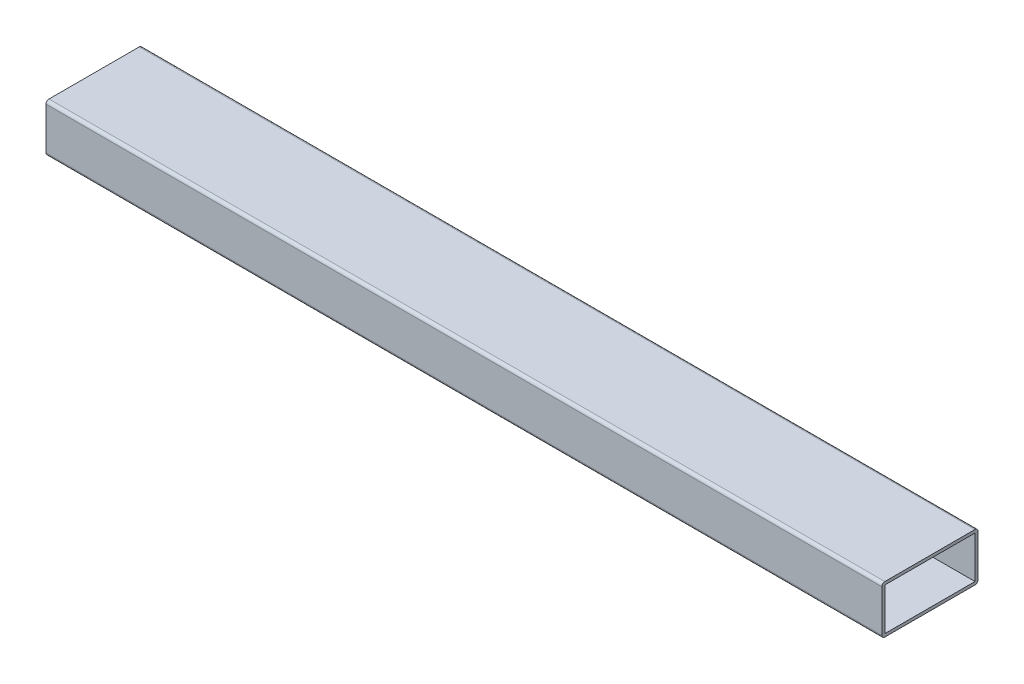
ISO-10303-21;
HEADER;
FILE_DESCRIPTION(('STEP AP214'),'2;1');
FILE_NAME('part.step','',(''),(''),'','','');
FILE_SCHEMA(('AUTOMOTIVE_DESIGN { 1 0 10303 214 1 1 1 1 }'));
ENDSEC;
DATA;
#1=APPLICATION_CONTEXT('core data for automotive mechanical design processes');
#2=APPLICATION_PROTOCOL_DEFINITION('international standard','automotive_design',2000,#1);
#3=PRODUCT_CONTEXT('',#1,'mechanical');
#4=PRODUCT('Part','Part','',(#3));
#5=PRODUCT_RELATED_PRODUCT_CATEGORY('part','',(#4));
#6=PRODUCT_DEFINITION_FORMATION('','',#4);
#7=PRODUCT_DEFINITION_CONTEXT('part definition',#1,'design');
#8=PRODUCT_DEFINITION('design','',#6,#7);
#9=PRODUCT_DEFINITION_SHAPE('','',#8);
#10=(LENGTH_UNIT() NAMED_UNIT(*) SI_UNIT(.MILLI.,.METRE.));
#11=(NAMED_UNIT(*) PLANE_ANGLE_UNIT() SI_UNIT($,.RADIAN.));
#12=(NAMED_UNIT(*) SI_UNIT($,.STERADIAN.) SOLID_ANGLE_UNIT());
#13=UNCERTAINTY_MEASURE_WITH_UNIT(LENGTH_MEASURE(1.E-05),#10,'distance_accuracy_value','');
#14=(GEOMETRIC_REPRESENTATION_CONTEXT(3) GLOBAL_UNCERTAINTY_ASSIGNED_CONTEXT((#13)) GLOBAL_UNIT_ASSIGNED_CONTEXT((#10,
#11,#12)) REPRESENTATION_CONTEXT('',''));
#15=CARTESIAN_POINT('',(0.,0.,0.));
#16=DIRECTION('',(0.,0.,1.));
#17=DIRECTION('',(1.,0.,0.));
#18=AXIS2_PLACEMENT_3D('',#15,#16,#17);
#19=CARTESIAN_POINT('',(441.450000004,0.,0.));
#20=DIRECTION('',(-1.,0.,0.));
#21=DIRECTION('',(0.,0.,1.));
#22=AXIS2_PLACEMENT_3D('',#19,#20,#21);
#23=PLANE('',#22);
#24=DIRECTION('',(0.,0.,-1.));
#25=VECTOR('',#24,1.);
#26=CARTESIAN_POINT('',(441.450000004,0.,0.));
#27=LINE('',#26,#25);
#28=CARTESIAN_POINT('',(441.450000004,0.,-1.5875));
#29=VERTEX_POINT('',#28);
#30=CARTESIAN_POINT('',(441.450000004,0.,-49.2125));
#31=VERTEX_POINT('',#30);
#32=EDGE_CURVE('E180',#29,#31,#27,.T.);
#33=ORIENTED_EDGE('',*,*,#32,.T.);
#34=CARTESIAN_POINT('',(441.450000004,1.5875,-49.2125));
#35=DIRECTION('',(-1.,0.,0.));
#36=DIRECTION('',(0.,0.,1.));
#37=AXIS2_PLACEMENT_3D('',#34,#35,#36);
#38=CIRCLE('',#37,1.5875);
#39=CARTESIAN_POINT('',(441.450000004,1.5875,-50.8));
#40=VERTEX_POINT('',#39);
#41=EDGE_CURVE('E240',#31,#40,#38,.F.);
#42=ORIENTED_EDGE('',*,*,#41,.T.);
#43=DIRECTION('',(0.,1.,0.));
#44=VECTOR('',#43,1.);
#45=CARTESIAN_POINT('',(441.450000004,0.,-50.8));
#46=LINE('',#45,#44);
#47=CARTESIAN_POINT('',(441.450000004,23.8125,-50.8));
#48=VERTEX_POINT('',#47);
#49=EDGE_CURVE('E185',#40,#48,#46,.T.);
#50=ORIENTED_EDGE('',*,*,#49,.T.);
#51=CARTESIAN_POINT('',(441.450000004,23.8125,-49.2125));
#52=DIRECTION('',(-1.,0.,0.));
#53=DIRECTION('',(0.,0.,1.));
#54=AXIS2_PLACEMENT_3D('',#51,#52,#53);
#55=CIRCLE('',#54,1.5875);
#56=CARTESIAN_POINT('',(441.450000004,25.4,-49.2125));
#57=VERTEX_POINT('',#56);
#58=EDGE_CURVE('E61',#48,#57,#55,.F.);
#59=ORIENTED_EDGE('',*,*,#58,.T.);
#60=DIRECTION('',(0.,0.,1.));
#61=VECTOR('',#60,1.);
#62=CARTESIAN_POINT('',(441.450000004,25.4,0.));
#63=LINE('',#62,#61);
#64=CARTESIAN_POINT('',(441.450000004,25.4,-1.5875));
#65=VERTEX_POINT('',#64);
#66=EDGE_CURVE('E188',#57,#65,#63,.T.);
#67=ORIENTED_EDGE('',*,*,#66,.T.);
#68=CARTESIAN_POINT('',(441.450000004,23.8125,-1.5875));
#69=DIRECTION('',(-1.,0.,0.));
#70=DIRECTION('',(0.,0.,1.));
#71=AXIS2_PLACEMENT_3D('',#68,#69,#70);
#72=CIRCLE('',#71,1.5875);
#73=CARTESIAN_POINT('',(441.450000004,23.8125,0.));
#74=VERTEX_POINT('',#73);
#75=EDGE_CURVE('E232',#65,#74,#72,.F.);
#76=ORIENTED_EDGE('',*,*,#75,.T.);
#77=DIRECTION('',(0.,-1.,0.));
#78=VECTOR('',#77,1.);
#79=CARTESIAN_POINT('',(441.450000004,0.,0.));
#80=LINE('',#79,#78);
#81=CARTESIAN_POINT('',(441.450000004,1.5875,0.));
#82=VERTEX_POINT('',#81);
#83=EDGE_CURVE('E176',#74,#82,#80,.T.);
#84=ORIENTED_EDGE('',*,*,#83,.T.);
#85=CARTESIAN_POINT('',(441.450000004,1.5875,-1.5875));
#86=DIRECTION('',(-1.,0.,0.));
#87=DIRECTION('',(0.,0.,1.));
#88=AXIS2_PLACEMENT_3D('',#85,#86,#87);
#89=CIRCLE('',#88,1.5875);
#90=EDGE_CURVE('E237',#82,#29,#89,.F.);
#91=ORIENTED_EDGE('',*,*,#90,.T.);
#92=EDGE_LOOP('',(#33,#42,#50,#59,#67,#76,#84,#91));
#93=FACE_BOUND('',#92,.T.);
#94=DIRECTION('',(0.,0.,1.));
#95=VECTOR('',#94,1.);
#96=CARTESIAN_POINT('',(441.450000004,1.5875,0.));
#97=LINE('',#96,#95);
#98=CARTESIAN_POINT('',(441.450000004,1.5875,-49.2125));
#99=VERTEX_POINT('',#98);
#100=CARTESIAN_POINT('',(441.450000004,1.5875,-1.5875));
#101=VERTEX_POINT('',#100);
#102=EDGE_CURVE('E138',#99,#101,#97,.T.);
#103=ORIENTED_EDGE('',*,*,#102,.T.);
#104=DIRECTION('',(0.,-1.,0.));
#105=VECTOR('',#104,1.);
#106=CARTESIAN_POINT('',(441.450000004,0.,-1.5875));
#107=LINE('',#106,#105);
#108=CARTESIAN_POINT('',(441.450000004,23.8125,-1.5875));
#109=VERTEX_POINT('',#108);
#110=EDGE_CURVE('E175',#109,#101,#107,.T.);
#111=ORIENTED_EDGE('',*,*,#110,.F.);
#112=DIRECTION('',(0.,0.,1.));
#113=VECTOR('',#112,1.);
#114=CARTESIAN_POINT('',(441.450000004,23.8125,0.));
#115=LINE('',#114,#113);
#116=CARTESIAN_POINT('',(441.450000004,23.8125,-49.2125));
#117=VERTEX_POINT('',#116);
#118=EDGE_CURVE('E252',#117,#109,#115,.T.);
#119=ORIENTED_EDGE('',*,*,#118,.F.);
#120=DIRECTION('',(0.,-1.,0.));
#121=VECTOR('',#120,1.);
#122=CARTESIAN_POINT('',(441.450000004,0.,-49.2125));
#123=LINE('',#122,#121);
#124=EDGE_CURVE('E197',#117,#99,#123,.T.);
#125=ORIENTED_EDGE('',*,*,#124,.T.);
#126=EDGE_LOOP('',(#103,#111,#119,#125));
#127=FACE_BOUND('',#126,.T.);
#128=ADVANCED_FACE('F39',(#93,#127),#23,.F.);
#129=CARTESIAN_POINT('',(0.,0.,0.));
#130=DIRECTION('',(-1.,0.,0.));
#131=DIRECTION('',(0.,0.,1.));
#132=AXIS2_PLACEMENT_3D('',#129,#130,#131);
#133=PLANE('',#132);
#134=DIRECTION('',(0.,1.,0.));
#135=VECTOR('',#134,1.);
#136=CARTESIAN_POINT('',(0.,0.,-50.8));
#137=LINE('',#136,#135);
#138=CARTESIAN_POINT('',(0.,1.5875,-50.8));
#139=VERTEX_POINT('',#138);
#140=CARTESIAN_POINT('',(0.,23.8125,-50.8));
#141=VERTEX_POINT('',#140);
#142=EDGE_CURVE('E201',#139,#141,#137,.T.);
#143=ORIENTED_EDGE('',*,*,#142,.F.);
#144=CARTESIAN_POINT('',(0.,1.5875,-49.2125));
#145=DIRECTION('',(-1.,0.,0.));
#146=DIRECTION('',(0.,0.,1.));
#147=AXIS2_PLACEMENT_3D('',#144,#145,#146);
#148=CIRCLE('',#147,1.5875);
#149=CARTESIAN_POINT('',(0.,0.,-49.2125));
#150=VERTEX_POINT('',#149);
#151=EDGE_CURVE('E222',#139,#150,#148,.T.);
#152=ORIENTED_EDGE('',*,*,#151,.T.);
#153=DIRECTION('',(0.,0.,-1.));
#154=VECTOR('',#153,1.);
#155=CARTESIAN_POINT('',(0.,0.,0.));
#156=LINE('',#155,#154);
#157=CARTESIAN_POINT('',(0.,0.,-1.5875));
#158=VERTEX_POINT('',#157);
#159=EDGE_CURVE('E196',#158,#150,#156,.T.);
#160=ORIENTED_EDGE('',*,*,#159,.F.);
#161=CARTESIAN_POINT('',(0.,1.5875,-1.5875));
#162=DIRECTION('',(-1.,0.,0.));
#163=DIRECTION('',(0.,0.,1.));
#164=AXIS2_PLACEMENT_3D('',#161,#162,#163);
#165=CIRCLE('',#164,1.5875);
#166=CARTESIAN_POINT('',(0.,1.5875,0.));
#167=VERTEX_POINT('',#166);
#168=EDGE_CURVE('E219',#158,#167,#165,.T.);
#169=ORIENTED_EDGE('',*,*,#168,.T.);
#170=DIRECTION('',(0.,-1.,0.));
#171=VECTOR('',#170,1.);
#172=CARTESIAN_POINT('',(0.,0.,0.));
#173=LINE('',#172,#171);
#174=CARTESIAN_POINT('',(0.,23.8125,0.));
#175=VERTEX_POINT('',#174);
#176=EDGE_CURVE('E192',#175,#167,#173,.T.);
#177=ORIENTED_EDGE('',*,*,#176,.F.);
#178=CARTESIAN_POINT('',(0.,23.8125,-1.5875));
#179=DIRECTION('',(-1.,0.,0.));
#180=DIRECTION('',(0.,0.,1.));
#181=AXIS2_PLACEMENT_3D('',#178,#179,#180);
#182=CIRCLE('',#181,1.5875);
#183=CARTESIAN_POINT('',(0.,25.4,-1.5875));
#184=VERTEX_POINT('',#183);
#185=EDGE_CURVE('E213',#175,#184,#182,.T.);
#186=ORIENTED_EDGE('',*,*,#185,.T.);
#187=DIRECTION('',(0.,0.,1.));
#188=VECTOR('',#187,1.);
#189=CARTESIAN_POINT('',(0.,25.4,0.));
#190=LINE('',#189,#188);
#191=CARTESIAN_POINT('',(0.,25.4,-49.2125));
#192=VERTEX_POINT('',#191);
#193=EDGE_CURVE('E181',#192,#184,#190,.T.);
#194=ORIENTED_EDGE('',*,*,#193,.F.);
#195=CARTESIAN_POINT('',(0.,23.8125,-49.2125));
#196=DIRECTION('',(-1.,0.,0.));
#197=DIRECTION('',(0.,0.,1.));
#198=AXIS2_PLACEMENT_3D('',#195,#196,#197);
#199=CIRCLE('',#198,1.5875);
#200=EDGE_CURVE('E216',#192,#141,#199,.T.);
#201=ORIENTED_EDGE('',*,*,#200,.T.);
#202=EDGE_LOOP('',(#143,#152,#160,#169,#177,#186,#194,#201));
#203=FACE_BOUND('',#202,.T.);
#204=DIRECTION('',(0.,1.,0.));
#205=VECTOR('',#204,1.);
#206=CARTESIAN_POINT('',(0.,0.,-1.5875));
#207=LINE('',#206,#205);
#208=CARTESIAN_POINT('',(0.,1.5875,-1.5875));
#209=VERTEX_POINT('',#208);
#210=CARTESIAN_POINT('',(0.,23.8125,-1.5875));
#211=VERTEX_POINT('',#210);
#212=EDGE_CURVE('E157',#209,#211,#207,.T.);
#213=ORIENTED_EDGE('',*,*,#212,.F.);
#214=DIRECTION('',(0.,0.,-1.));
#215=VECTOR('',#214,1.);
#216=CARTESIAN_POINT('',(0.,1.5875,0.));
#217=LINE('',#216,#215);
#218=CARTESIAN_POINT('',(0.,1.5875,-49.2125));
#219=VERTEX_POINT('',#218);
#220=EDGE_CURVE('E135',#209,#219,#217,.T.);
#221=ORIENTED_EDGE('',*,*,#220,.T.);
#222=DIRECTION('',(0.,1.,0.));
#223=VECTOR('',#222,1.);
#224=CARTESIAN_POINT('',(0.,0.,-49.2125));
#225=LINE('',#224,#223);
#226=CARTESIAN_POINT('',(0.,23.8125,-49.2125));
#227=VERTEX_POINT('',#226);
#228=EDGE_CURVE('E147',#219,#227,#225,.T.);
#229=ORIENTED_EDGE('',*,*,#228,.T.);
#230=DIRECTION('',(0.,0.,-1.));
#231=VECTOR('',#230,1.);
#232=CARTESIAN_POINT('',(0.,23.8125,0.));
#233=LINE('',#232,#231);
#234=EDGE_CURVE('E143',#211,#227,#233,.T.);
#235=ORIENTED_EDGE('',*,*,#234,.F.);
#236=EDGE_LOOP('',(#213,#221,#229,#235));
#237=FACE_BOUND('',#236,.T.);
#238=ADVANCED_FACE('F155',(#203,#237),#133,.T.);
#239=CARTESIAN_POINT('',(441.450000004,0.,0.));
#240=DIRECTION('',(0.,0.,-1.));
#241=DIRECTION('',(-1.,0.,0.));
#242=AXIS2_PLACEMENT_3D('',#239,#240,#241);
#243=PLANE('',#242);
#244=ORIENTED_EDGE('',*,*,#176,.T.);
#245=DIRECTION('',(-1.,0.,0.));
#246=VECTOR('',#245,1.);
#247=CARTESIAN_POINT('',(441.450000004,1.5875,0.));
#248=LINE('',#247,#246);
#249=EDGE_CURVE('E247',#167,#82,#248,.F.);
#250=ORIENTED_EDGE('',*,*,#249,.T.);
#251=ORIENTED_EDGE('',*,*,#83,.F.);
#252=DIRECTION('',(-1.,0.,0.));
#253=VECTOR('',#252,1.);
#254=CARTESIAN_POINT('',(441.450000004,23.8125,0.));
#255=LINE('',#254,#253);
#256=EDGE_CURVE('E243',#74,#175,#255,.T.);
#257=ORIENTED_EDGE('',*,*,#256,.T.);
#258=EDGE_LOOP('',(#244,#250,#251,#257));
#259=FACE_BOUND('',#258,.T.);
#260=ADVANCED_FACE('F278',(#259),#243,.F.);
#261=CARTESIAN_POINT('',(441.450000004,0.,0.));
#262=DIRECTION('',(0.,1.,0.));
#263=DIRECTION('',(0.,0.,1.));
#264=AXIS2_PLACEMENT_3D('',#261,#262,#263);
#265=PLANE('',#264);
#266=ORIENTED_EDGE('',*,*,#159,.T.);
#267=DIRECTION('',(-1.,0.,0.));
#268=VECTOR('',#267,1.);
#269=CARTESIAN_POINT('',(441.450000004,0.,-49.2125));
#270=LINE('',#269,#268);
#271=EDGE_CURVE('E229',#150,#31,#270,.F.);
#272=ORIENTED_EDGE('',*,*,#271,.T.);
#273=ORIENTED_EDGE('',*,*,#32,.F.);
#274=DIRECTION('',(-1.,0.,0.));
#275=VECTOR('',#274,1.);
#276=CARTESIAN_POINT('',(441.450000004,0.,-1.5875));
#277=LINE('',#276,#275);
#278=EDGE_CURVE('E225',#29,#158,#277,.T.);
#279=ORIENTED_EDGE('',*,*,#278,.T.);
#280=EDGE_LOOP('',(#266,#272,#273,#279));
#281=FACE_BOUND('',#280,.T.);
#282=ADVANCED_FACE('F289',(#281),#265,.F.);
#283=CARTESIAN_POINT('',(441.450000004,0.,-50.8));
#284=DIRECTION('',(0.,0.,1.));
#285=DIRECTION('',(1.,0.,0.));
#286=AXIS2_PLACEMENT_3D('',#283,#284,#285);
#287=PLANE('',#286);
#288=ORIENTED_EDGE('',*,*,#49,.F.);
#289=DIRECTION('',(-1.,0.,0.));
#290=VECTOR('',#289,1.);
#291=CARTESIAN_POINT('',(441.450000004,1.5875,-50.8));
#292=LINE('',#291,#290);
#293=EDGE_CURVE('E209',#40,#139,#292,.T.);
#294=ORIENTED_EDGE('',*,*,#293,.T.);
#295=ORIENTED_EDGE('',*,*,#142,.T.);
#296=DIRECTION('',(-1.,0.,0.));
#297=VECTOR('',#296,1.);
#298=CARTESIAN_POINT('',(441.450000004,23.8125,-50.8));
#299=LINE('',#298,#297);
#300=EDGE_CURVE('E191',#141,#48,#299,.F.);
#301=ORIENTED_EDGE('',*,*,#300,.T.);
#302=EDGE_LOOP('',(#288,#294,#295,#301));
#303=FACE_BOUND('',#302,.T.);
#304=ADVANCED_FACE('F286',(#303),#287,.F.);
#305=CARTESIAN_POINT('',(441.450000004,25.4,0.));
#306=DIRECTION('',(0.,-1.,0.));
#307=DIRECTION('',(0.,0.,-1.));
#308=AXIS2_PLACEMENT_3D('',#305,#306,#307);
#309=PLANE('',#308);
#310=ORIENTED_EDGE('',*,*,#66,.F.);
#311=DIRECTION('',(-1.,0.,0.));
#312=VECTOR('',#311,1.);
#313=CARTESIAN_POINT('',(441.450000004,25.4,-49.2125));
#314=LINE('',#313,#312);
#315=EDGE_CURVE('E11',#57,#192,#314,.T.);
#316=ORIENTED_EDGE('',*,*,#315,.T.);
#317=ORIENTED_EDGE('',*,*,#193,.T.);
#318=DIRECTION('',(-1.,0.,0.));
#319=VECTOR('',#318,1.);
#320=CARTESIAN_POINT('',(441.450000004,25.4,-1.5875));
#321=LINE('',#320,#319);
#322=EDGE_CURVE('E48',#184,#65,#321,.F.);
#323=ORIENTED_EDGE('',*,*,#322,.T.);
#324=EDGE_LOOP('',(#310,#316,#317,#323));
#325=FACE_BOUND('',#324,.T.);
#326=ADVANCED_FACE('F283',(#325),#309,.F.);
#327=CARTESIAN_POINT('',(494.005601513259,1.5875,0.));
#328=DIRECTION('',(0.,1.,0.));
#329=DIRECTION('',(0.,0.,1.));
#330=AXIS2_PLACEMENT_3D('',#327,#328,#329);
#331=PLANE('',#330);
#332=DIRECTION('',(-1.,0.,0.));
#333=VECTOR('',#332,1.);
#334=CARTESIAN_POINT('',(494.005601513259,1.5875,-49.2125));
#335=LINE('',#334,#333);
#336=EDGE_CURVE('E130',#99,#219,#335,.T.);
#337=ORIENTED_EDGE('',*,*,#336,.T.);
#338=ORIENTED_EDGE('',*,*,#220,.F.);
#339=DIRECTION('',(-1.,0.,0.));
#340=VECTOR('',#339,1.);
#341=CARTESIAN_POINT('',(494.005601513259,1.5875,-1.5875));
#342=LINE('',#341,#340);
#343=EDGE_CURVE('E142',#101,#209,#342,.T.);
#344=ORIENTED_EDGE('',*,*,#343,.F.);
#345=ORIENTED_EDGE('',*,*,#102,.F.);
#346=EDGE_LOOP('',(#337,#338,#344,#345));
#347=FACE_BOUND('',#346,.T.);
#348=ADVANCED_FACE('F132',(#347),#331,.T.);
#349=CARTESIAN_POINT('',(494.005601513259,0.,-1.5875));
#350=DIRECTION('',(0.,0.,1.));
#351=DIRECTION('',(1.,0.,0.));
#352=AXIS2_PLACEMENT_3D('',#349,#350,#351);
#353=PLANE('',#352);
#354=ORIENTED_EDGE('',*,*,#110,.T.);
#355=ORIENTED_EDGE('',*,*,#343,.T.);
#356=ORIENTED_EDGE('',*,*,#212,.T.);
#357=DIRECTION('',(-1.,0.,0.));
#358=VECTOR('',#357,1.);
#359=CARTESIAN_POINT('',(494.005601513259,23.8125,-1.5875));
#360=LINE('',#359,#358);
#361=EDGE_CURVE('E168',#109,#211,#360,.T.);
#362=ORIENTED_EDGE('',*,*,#361,.F.);
#363=EDGE_LOOP('',(#354,#355,#356,#362));
#364=FACE_BOUND('',#363,.T.);
#365=ADVANCED_FACE('F259',(#364),#353,.F.);
#366=CARTESIAN_POINT('',(494.005601513259,23.8125,0.));
#367=DIRECTION('',(0.,1.,0.));
#368=DIRECTION('',(0.,0.,1.));
#369=AXIS2_PLACEMENT_3D('',#366,#367,#368);
#370=PLANE('',#369);
#371=ORIENTED_EDGE('',*,*,#118,.T.);
#372=ORIENTED_EDGE('',*,*,#361,.T.);
#373=ORIENTED_EDGE('',*,*,#234,.T.);
#374=DIRECTION('',(-1.,0.,0.));
#375=VECTOR('',#374,1.);
#376=CARTESIAN_POINT('',(494.005601513259,23.8125,-49.2125));
#377=LINE('',#376,#375);
#378=EDGE_CURVE('E150',#117,#227,#377,.T.);
#379=ORIENTED_EDGE('',*,*,#378,.F.);
#380=EDGE_LOOP('',(#371,#372,#373,#379));
#381=FACE_BOUND('',#380,.T.);
#382=ADVANCED_FACE('F263',(#381),#370,.F.);
#383=CARTESIAN_POINT('',(494.005601513259,0.,-49.2125));
#384=DIRECTION('',(0.,0.,1.));
#385=DIRECTION('',(1.,0.,0.));
#386=AXIS2_PLACEMENT_3D('',#383,#384,#385);
#387=PLANE('',#386);
#388=ORIENTED_EDGE('',*,*,#378,.T.);
#389=ORIENTED_EDGE('',*,*,#228,.F.);
#390=ORIENTED_EDGE('',*,*,#336,.F.);
#391=ORIENTED_EDGE('',*,*,#124,.F.);
#392=EDGE_LOOP('',(#388,#389,#390,#391));
#393=FACE_BOUND('',#392,.T.);
#394=ADVANCED_FACE('F148',(#393),#387,.T.);
#395=CARTESIAN_POINT('',(441.450000004,1.5875,-49.2125));
#396=DIRECTION('',(-1.,0.,0.));
#397=DIRECTION('',(0.,0.,1.));
#398=AXIS2_PLACEMENT_3D('',#395,#396,#397);
#399=CYLINDRICAL_SURFACE('',#398,1.5875);
#400=ORIENTED_EDGE('',*,*,#41,.F.);
#401=ORIENTED_EDGE('',*,*,#271,.F.);
#402=ORIENTED_EDGE('',*,*,#151,.F.);
#403=ORIENTED_EDGE('',*,*,#293,.F.);
#404=EDGE_LOOP('',(#400,#401,#402,#403));
#405=FACE_BOUND('',#404,.T.);
#406=ADVANCED_FACE('F270',(#405),#399,.T.);
#407=CARTESIAN_POINT('',(441.450000004,1.5875,-1.5875));
#408=DIRECTION('',(-1.,0.,0.));
#409=DIRECTION('',(0.,0.,1.));
#410=AXIS2_PLACEMENT_3D('',#407,#408,#409);
#411=CYLINDRICAL_SURFACE('',#410,1.5875);
#412=ORIENTED_EDGE('',*,*,#90,.F.);
#413=ORIENTED_EDGE('',*,*,#249,.F.);
#414=ORIENTED_EDGE('',*,*,#168,.F.);
#415=ORIENTED_EDGE('',*,*,#278,.F.);
#416=EDGE_LOOP('',(#412,#413,#414,#415));
#417=FACE_BOUND('',#416,.T.);
#418=ADVANCED_FACE('F299',(#417),#411,.T.);
#419=CARTESIAN_POINT('',(441.450000004,23.8125,-49.2125));
#420=DIRECTION('',(-1.,0.,0.));
#421=DIRECTION('',(0.,0.,1.));
#422=AXIS2_PLACEMENT_3D('',#419,#420,#421);
#423=CYLINDRICAL_SURFACE('',#422,1.5875);
#424=ORIENTED_EDGE('',*,*,#58,.F.);
#425=ORIENTED_EDGE('',*,*,#300,.F.);
#426=ORIENTED_EDGE('',*,*,#200,.F.);
#427=ORIENTED_EDGE('',*,*,#315,.F.);
#428=EDGE_LOOP('',(#424,#425,#426,#427));
#429=FACE_BOUND('',#428,.T.);
#430=ADVANCED_FACE('F302',(#429),#423,.T.);
#431=CARTESIAN_POINT('',(441.450000004,23.8125,-1.5875));
#432=DIRECTION('',(-1.,0.,0.));
#433=DIRECTION('',(0.,0.,1.));
#434=AXIS2_PLACEMENT_3D('',#431,#432,#433);
#435=CYLINDRICAL_SURFACE('',#434,1.5875);
#436=ORIENTED_EDGE('',*,*,#75,.F.);
#437=ORIENTED_EDGE('',*,*,#322,.F.);
#438=ORIENTED_EDGE('',*,*,#185,.F.);
#439=ORIENTED_EDGE('',*,*,#256,.F.);
#440=EDGE_LOOP('',(#436,#437,#438,#439));
#441=FACE_BOUND('',#440,.T.);
#442=ADVANCED_FACE('F41',(#441),#435,.T.);
#443=CLOSED_SHELL('',(#128,#238,#260,#282,#304,#326,#348,#365,#382,#394,#406,#418,#430,#442));
#444=MANIFOLD_SOLID_BREP('B2',#443);
#445=ADVANCED_BREP_SHAPE_REPRESENTATION('',(#18,#444),#14);
#446=SHAPE_DEFINITION_REPRESENTATION(#9,#445);
ENDSEC;
END-ISO-10303-21;
